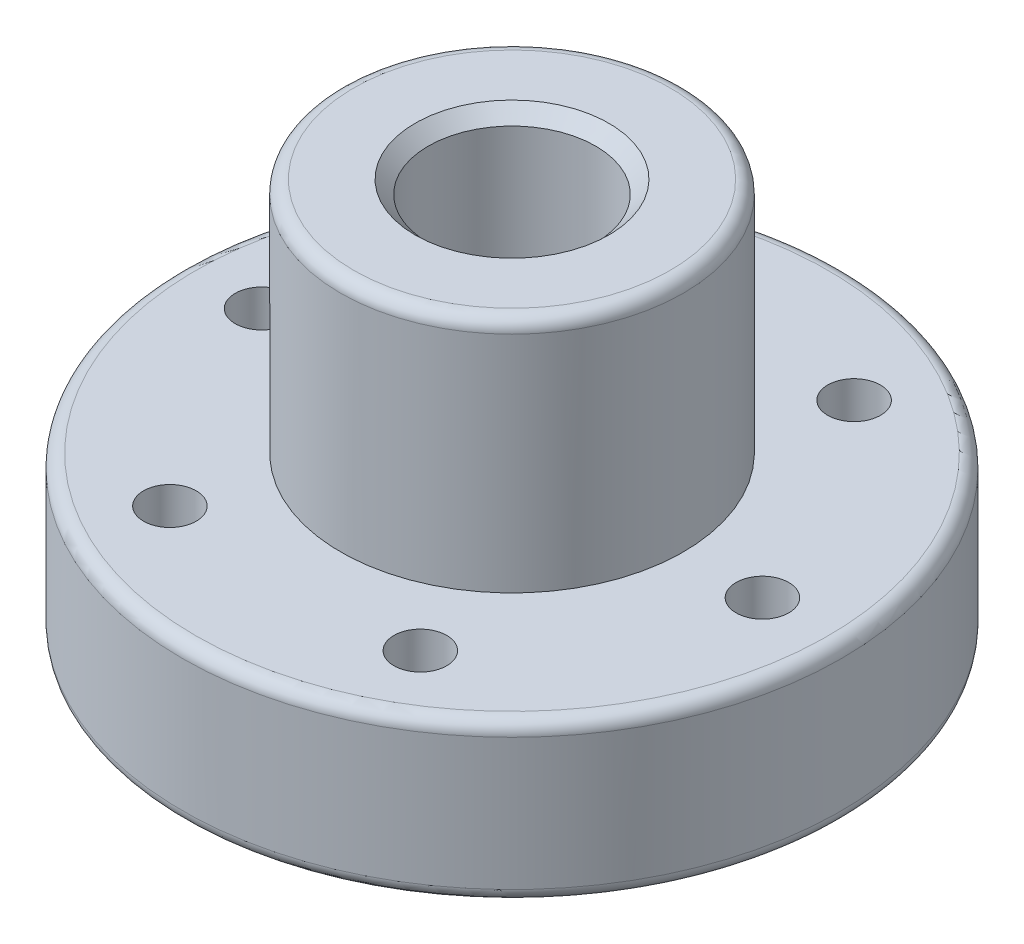
ISO-10303-21;
HEADER;
FILE_DESCRIPTION(('STEP AP214'),'2;1');
FILE_NAME('part.step','',(''),(''),'','','');
FILE_SCHEMA(('AUTOMOTIVE_DESIGN { 1 0 10303 214 1 1 1 1 }'));
ENDSEC;
DATA;
#1=APPLICATION_CONTEXT('core data for automotive mechanical design processes');
#2=APPLICATION_PROTOCOL_DEFINITION('international standard','automotive_design',2000,#1);
#3=PRODUCT_CONTEXT('',#1,'mechanical');
#4=PRODUCT('Part','Part','',(#3));
#5=PRODUCT_RELATED_PRODUCT_CATEGORY('part','',(#4));
#6=PRODUCT_DEFINITION_FORMATION('','',#4);
#7=PRODUCT_DEFINITION_CONTEXT('part definition',#1,'design');
#8=PRODUCT_DEFINITION('design','',#6,#7);
#9=PRODUCT_DEFINITION_SHAPE('','',#8);
#10=(LENGTH_UNIT() NAMED_UNIT(*) SI_UNIT(.MILLI.,.METRE.));
#11=(NAMED_UNIT(*) PLANE_ANGLE_UNIT() SI_UNIT($,.RADIAN.));
#12=(NAMED_UNIT(*) SI_UNIT($,.STERADIAN.) SOLID_ANGLE_UNIT());
#13=UNCERTAINTY_MEASURE_WITH_UNIT(LENGTH_MEASURE(1.E-05),#10,'distance_accuracy_value','');
#14=(GEOMETRIC_REPRESENTATION_CONTEXT(3) GLOBAL_UNCERTAINTY_ASSIGNED_CONTEXT((#13)) GLOBAL_UNIT_ASSIGNED_CONTEXT((#10,
#11,#12)) REPRESENTATION_CONTEXT('',''));
#15=CARTESIAN_POINT('',(0.,0.,0.));
#16=DIRECTION('',(0.,0.,1.));
#17=DIRECTION('',(1.,0.,0.));
#18=AXIS2_PLACEMENT_3D('',#15,#16,#17);
#19=CARTESIAN_POINT('',(6.5,15.,0.));
#20=DIRECTION('',(0.,1.,0.));
#21=DIRECTION('',(0.,0.,1.));
#22=AXIS2_PLACEMENT_3D('',#19,#20,#21);
#23=PLANE('',#22);
#24=CARTESIAN_POINT('',(0.,15.,0.));
#25=DIRECTION('',(0.,1.,0.));
#26=DIRECTION('',(0.,0.,1.));
#27=AXIS2_PLACEMENT_3D('',#24,#25,#26);
#28=CIRCLE('',#27,3.675);
#29=CARTESIAN_POINT('',(0.,15.,3.675));
#30=VERTEX_POINT('',#29);
#31=EDGE_CURVE('E10',#30,#30,#28,.F.);
#32=ORIENTED_EDGE('',*,*,#31,.T.);
#33=EDGE_LOOP('',(#32));
#34=FACE_BOUND('',#33,.T.);
#35=CARTESIAN_POINT('',(0.,15.,0.));
#36=DIRECTION('',(0.,1.,0.));
#37=DIRECTION('',(0.,0.,1.));
#38=AXIS2_PLACEMENT_3D('',#35,#36,#37);
#39=CIRCLE('',#38,6.);
#40=CARTESIAN_POINT('',(0.,15.,6.));
#41=VERTEX_POINT('',#40);
#42=EDGE_CURVE('E78',#41,#41,#39,.T.);
#43=ORIENTED_EDGE('',*,*,#42,.T.);
#44=EDGE_LOOP('',(#43));
#45=FACE_BOUND('',#44,.T.);
#46=ADVANCED_FACE('F45',(#34,#45),#23,.T.);
#47=CARTESIAN_POINT('',(0.,0.,0.));
#48=DIRECTION('',(0.,-1.,0.));
#49=DIRECTION('',(0.,0.,-1.));
#50=AXIS2_PLACEMENT_3D('',#47,#48,#49);
#51=CYLINDRICAL_SURFACE('',#50,3.175);
#52=CARTESIAN_POINT('',(0.,0.5,0.));
#53=DIRECTION('',(0.,-1.,0.));
#54=DIRECTION('',(0.,0.,-1.));
#55=AXIS2_PLACEMENT_3D('',#52,#53,#54);
#56=CIRCLE('',#55,3.175);
#57=CARTESIAN_POINT('',(0.,0.5,-3.175));
#58=VERTEX_POINT('',#57);
#59=EDGE_CURVE('E57',#58,#58,#56,.T.);
#60=ORIENTED_EDGE('',*,*,#59,.T.);
#61=EDGE_LOOP('',(#60));
#62=FACE_BOUND('',#61,.T.);
#63=CARTESIAN_POINT('',(0.,14.5,0.));
#64=DIRECTION('',(0.,1.,0.));
#65=DIRECTION('',(0.,0.,1.));
#66=AXIS2_PLACEMENT_3D('',#63,#64,#65);
#67=CIRCLE('',#66,3.175);
#68=CARTESIAN_POINT('',(0.,14.5,3.175));
#69=VERTEX_POINT('',#68);
#70=EDGE_CURVE('E61',#69,#69,#67,.T.);
#71=ORIENTED_EDGE('',*,*,#70,.T.);
#72=EDGE_LOOP('',(#71));
#73=FACE_BOUND('',#72,.T.);
#74=ADVANCED_FACE('F159',(#62,#73),#51,.F.);
#75=CARTESIAN_POINT('',(12.5,0.,0.));
#76=DIRECTION('',(0.,-1.,0.));
#77=DIRECTION('',(0.,0.,-1.));
#78=AXIS2_PLACEMENT_3D('',#75,#76,#77);
#79=PLANE('',#78);
#80=CARTESIAN_POINT('',(0.,0.,0.));
#81=DIRECTION('',(0.,-1.,0.));
#82=DIRECTION('',(0.,0.,-1.));
#83=AXIS2_PLACEMENT_3D('',#80,#81,#82);
#84=CIRCLE('',#83,3.675);
#85=CARTESIAN_POINT('',(0.,0.,-3.675));
#86=VERTEX_POINT('',#85);
#87=EDGE_CURVE('E53',#86,#86,#84,.F.);
#88=ORIENTED_EDGE('',*,*,#87,.T.);
#89=EDGE_LOOP('',(#88));
#90=FACE_BOUND('',#89,.T.);
#91=CARTESIAN_POINT('',(0.,0.,0.));
#92=DIRECTION('',(0.,-1.,0.));
#93=DIRECTION('',(0.,0.,-1.));
#94=AXIS2_PLACEMENT_3D('',#91,#92,#93);
#95=CIRCLE('',#94,12.);
#96=CARTESIAN_POINT('',(0.,0.,-12.));
#97=VERTEX_POINT('',#96);
#98=EDGE_CURVE('E75',#97,#97,#95,.T.);
#99=ORIENTED_EDGE('',*,*,#98,.T.);
#100=EDGE_LOOP('',(#99));
#101=FACE_BOUND('',#100,.T.);
#102=CARTESIAN_POINT('',(4.7500000000001,0.,-8.22724133595211));
#103=DIRECTION('',(0.,1.,0.));
#104=DIRECTION('',(0.866025403784433,0.,0.50000000000001));
#105=AXIS2_PLACEMENT_3D('',#102,#103,#104);
#106=CIRCLE('',#105,1.00000000000001);
#107=CARTESIAN_POINT('',(5.61602540378453,0.,-7.7272413359521));
#108=VERTEX_POINT('',#107);
#109=EDGE_CURVE('E103',#108,#108,#106,.T.);
#110=ORIENTED_EDGE('',*,*,#109,.T.);
#111=EDGE_LOOP('',(#110));
#112=FACE_BOUND('',#111,.T.);
#113=CARTESIAN_POINT('',(-4.74999999999992,0.,-8.22724133595221));
#114=DIRECTION('',(0.,1.,0.));
#115=DIRECTION('',(0.866025403784443,0.,-0.499999999999992));
#116=AXIS2_PLACEMENT_3D('',#113,#114,#115);
#117=CIRCLE('',#116,1.00000000000001);
#118=CARTESIAN_POINT('',(-3.88397459621547,0.,-8.7272413359522));
#119=VERTEX_POINT('',#118);
#120=EDGE_CURVE('E109',#119,#119,#117,.T.);
#121=ORIENTED_EDGE('',*,*,#120,.T.);
#122=EDGE_LOOP('',(#121));
#123=FACE_BOUND('',#122,.T.);
#124=CARTESIAN_POINT('',(-9.5,0.,0.));
#125=DIRECTION('',(0.,1.,0.));
#126=DIRECTION('',(0.,0.,-1.));
#127=AXIS2_PLACEMENT_3D('',#124,#125,#126);
#128=CIRCLE('',#127,1.00000000000001);
#129=CARTESIAN_POINT('',(-9.5,0.,-1.00000000000001));
#130=VERTEX_POINT('',#129);
#131=EDGE_CURVE('E115',#130,#130,#128,.T.);
#132=ORIENTED_EDGE('',*,*,#131,.T.);
#133=EDGE_LOOP('',(#132));
#134=FACE_BOUND('',#133,.T.);
#135=CARTESIAN_POINT('',(-4.75000000000004,0.,8.22724133595214));
#136=DIRECTION('',(0.,1.,0.));
#137=DIRECTION('',(-0.866025403784436,0.,-0.500000000000004));
#138=AXIS2_PLACEMENT_3D('',#135,#136,#137);
#139=CIRCLE('',#138,1.00000000000001);
#140=CARTESIAN_POINT('',(-5.61602540378448,0.,7.72724133595214));
#141=VERTEX_POINT('',#140);
#142=EDGE_CURVE('E97',#141,#141,#139,.T.);
#143=ORIENTED_EDGE('',*,*,#142,.T.);
#144=EDGE_LOOP('',(#143));
#145=FACE_BOUND('',#144,.T.);
#146=CARTESIAN_POINT('',(4.74999999999998,0.,8.22724133595218));
#147=DIRECTION('',(0.,1.,0.));
#148=DIRECTION('',(-0.86602540378444,0.,0.499999999999998));
#149=AXIS2_PLACEMENT_3D('',#146,#147,#148);
#150=CIRCLE('',#149,1.00000000000001);
#151=CARTESIAN_POINT('',(3.88397459621554,0.,8.72724133595218));
#152=VERTEX_POINT('',#151);
#153=EDGE_CURVE('E91',#152,#152,#150,.T.);
#154=ORIENTED_EDGE('',*,*,#153,.T.);
#155=EDGE_LOOP('',(#154));
#156=FACE_BOUND('',#155,.T.);
#157=CARTESIAN_POINT('',(9.5,0.,0.));
#158=DIRECTION('',(0.,1.,0.));
#159=DIRECTION('',(0.,0.,1.));
#160=AXIS2_PLACEMENT_3D('',#157,#158,#159);
#161=CIRCLE('',#160,1.00000000000001);
#162=CARTESIAN_POINT('',(9.5,0.,1.00000000000001));
#163=VERTEX_POINT('',#162);
#164=EDGE_CURVE('E87',#163,#163,#161,.T.);
#165=ORIENTED_EDGE('',*,*,#164,.T.);
#166=EDGE_LOOP('',(#165));
#167=FACE_BOUND('',#166,.T.);
#168=ADVANCED_FACE('F124',(#90,#101,#112,#123,#134,#145,#156,#167),#79,.T.);
#169=CARTESIAN_POINT('',(0.,0.,0.));
#170=DIRECTION('',(0.,-1.,0.));
#171=DIRECTION('',(0.,0.,-1.));
#172=AXIS2_PLACEMENT_3D('',#169,#170,#171);
#173=CYLINDRICAL_SURFACE('',#172,12.5);
#174=CARTESIAN_POINT('',(0.,0.5,0.));
#175=DIRECTION('',(0.,-1.,0.));
#176=DIRECTION('',(0.,0.,-1.));
#177=AXIS2_PLACEMENT_3D('',#174,#175,#176);
#178=CIRCLE('',#177,12.5);
#179=CARTESIAN_POINT('',(0.,0.5,-12.5));
#180=VERTEX_POINT('',#179);
#181=EDGE_CURVE('E69',#180,#180,#178,.F.);
#182=ORIENTED_EDGE('',*,*,#181,.T.);
#183=EDGE_LOOP('',(#182));
#184=FACE_BOUND('',#183,.T.);
#185=CARTESIAN_POINT('',(0.,5.5,0.));
#186=DIRECTION('',(0.,1.,0.));
#187=DIRECTION('',(0.,0.,1.));
#188=AXIS2_PLACEMENT_3D('',#185,#186,#187);
#189=CIRCLE('',#188,12.5);
#190=CARTESIAN_POINT('',(0.,5.5,12.5));
#191=VERTEX_POINT('',#190);
#192=EDGE_CURVE('E72',#191,#191,#189,.F.);
#193=ORIENTED_EDGE('',*,*,#192,.T.);
#194=EDGE_LOOP('',(#193));
#195=FACE_BOUND('',#194,.T.);
#196=ADVANCED_FACE('F139',(#184,#195),#173,.T.);
#197=CARTESIAN_POINT('',(6.5,6.,0.));
#198=DIRECTION('',(0.,1.,0.));
#199=DIRECTION('',(0.,0.,1.));
#200=AXIS2_PLACEMENT_3D('',#197,#198,#199);
#201=PLANE('',#200);
#202=CARTESIAN_POINT('',(0.,6.,0.));
#203=DIRECTION('',(0.,1.,0.));
#204=DIRECTION('',(0.,0.,1.));
#205=AXIS2_PLACEMENT_3D('',#202,#203,#204);
#206=CIRCLE('',#205,12.);
#207=CARTESIAN_POINT('',(0.,6.,12.));
#208=VERTEX_POINT('',#207);
#209=EDGE_CURVE('E66',#208,#208,#206,.T.);
#210=ORIENTED_EDGE('',*,*,#209,.T.);
#211=EDGE_LOOP('',(#210));
#212=FACE_BOUND('',#211,.T.);
#213=CARTESIAN_POINT('',(4.7500000000001,6.,-8.22724133595211));
#214=DIRECTION('',(0.,1.,0.));
#215=DIRECTION('',(0.866025403784433,0.,0.50000000000001));
#216=AXIS2_PLACEMENT_3D('',#213,#214,#215);
#217=CIRCLE('',#216,1.00000000000001);
#218=CARTESIAN_POINT('',(5.61602540378453,6.,-7.7272413359521));
#219=VERTEX_POINT('',#218);
#220=EDGE_CURVE('E100',#219,#219,#217,.T.);
#221=ORIENTED_EDGE('',*,*,#220,.F.);
#222=EDGE_LOOP('',(#221));
#223=FACE_BOUND('',#222,.T.);
#224=CARTESIAN_POINT('',(-4.74999999999992,6.,-8.22724133595221));
#225=DIRECTION('',(0.,1.,0.));
#226=DIRECTION('',(0.866025403784443,0.,-0.499999999999992));
#227=AXIS2_PLACEMENT_3D('',#224,#225,#226);
#228=CIRCLE('',#227,1.00000000000001);
#229=CARTESIAN_POINT('',(-3.88397459621547,6.,-8.7272413359522));
#230=VERTEX_POINT('',#229);
#231=EDGE_CURVE('E106',#230,#230,#228,.T.);
#232=ORIENTED_EDGE('',*,*,#231,.F.);
#233=EDGE_LOOP('',(#232));
#234=FACE_BOUND('',#233,.T.);
#235=CARTESIAN_POINT('',(-9.5,6.,0.));
#236=DIRECTION('',(0.,1.,0.));
#237=DIRECTION('',(0.,0.,-1.));
#238=AXIS2_PLACEMENT_3D('',#235,#236,#237);
#239=CIRCLE('',#238,1.00000000000001);
#240=CARTESIAN_POINT('',(-9.5,6.,-1.00000000000001));
#241=VERTEX_POINT('',#240);
#242=EDGE_CURVE('E112',#241,#241,#239,.T.);
#243=ORIENTED_EDGE('',*,*,#242,.F.);
#244=EDGE_LOOP('',(#243));
#245=FACE_BOUND('',#244,.T.);
#246=CARTESIAN_POINT('',(-4.75000000000004,6.,8.22724133595214));
#247=DIRECTION('',(0.,1.,0.));
#248=DIRECTION('',(-0.866025403784436,0.,-0.500000000000004));
#249=AXIS2_PLACEMENT_3D('',#246,#247,#248);
#250=CIRCLE('',#249,1.00000000000001);
#251=CARTESIAN_POINT('',(-5.61602540378448,6.,7.72724133595214));
#252=VERTEX_POINT('',#251);
#253=EDGE_CURVE('E118',#252,#252,#250,.T.);
#254=ORIENTED_EDGE('',*,*,#253,.F.);
#255=EDGE_LOOP('',(#254));
#256=FACE_BOUND('',#255,.T.);
#257=CARTESIAN_POINT('',(4.74999999999998,6.,8.22724133595218));
#258=DIRECTION('',(0.,1.,0.));
#259=DIRECTION('',(-0.86602540378444,0.,0.499999999999998));
#260=AXIS2_PLACEMENT_3D('',#257,#258,#259);
#261=CIRCLE('',#260,1.00000000000001);
#262=CARTESIAN_POINT('',(3.88397459621554,6.,8.72724133595218));
#263=VERTEX_POINT('',#262);
#264=EDGE_CURVE('E94',#263,#263,#261,.T.);
#265=ORIENTED_EDGE('',*,*,#264,.F.);
#266=EDGE_LOOP('',(#265));
#267=FACE_BOUND('',#266,.T.);
#268=CARTESIAN_POINT('',(9.5,6.,0.));
#269=DIRECTION('',(0.,1.,0.));
#270=DIRECTION('',(0.,0.,1.));
#271=AXIS2_PLACEMENT_3D('',#268,#269,#270);
#272=CIRCLE('',#271,1.00000000000001);
#273=CARTESIAN_POINT('',(9.5,6.,1.00000000000001));
#274=VERTEX_POINT('',#273);
#275=EDGE_CURVE('E88',#274,#274,#272,.T.);
#276=ORIENTED_EDGE('',*,*,#275,.F.);
#277=EDGE_LOOP('',(#276));
#278=FACE_BOUND('',#277,.T.);
#279=CARTESIAN_POINT('',(0.,6.,0.));
#280=DIRECTION('',(0.,-1.,0.));
#281=DIRECTION('',(0.,0.,-1.));
#282=AXIS2_PLACEMENT_3D('',#279,#280,#281);
#283=CIRCLE('',#282,6.5);
#284=CARTESIAN_POINT('',(0.,6.,-6.5));
#285=VERTEX_POINT('',#284);
#286=EDGE_CURVE('E84',#285,#285,#283,.T.);
#287=ORIENTED_EDGE('',*,*,#286,.T.);
#288=EDGE_LOOP('',(#287));
#289=FACE_BOUND('',#288,.T.);
#290=ADVANCED_FACE('F135',(#212,#223,#234,#245,#256,#267,#278,#289),#201,.T.);
#291=CARTESIAN_POINT('',(0.,0.,0.));
#292=DIRECTION('',(0.,-1.,0.));
#293=DIRECTION('',(0.,0.,-1.));
#294=AXIS2_PLACEMENT_3D('',#291,#292,#293);
#295=CYLINDRICAL_SURFACE('',#294,6.5);
#296=CARTESIAN_POINT('',(0.,14.5,0.));
#297=DIRECTION('',(0.,1.,0.));
#298=DIRECTION('',(0.,0.,1.));
#299=AXIS2_PLACEMENT_3D('',#296,#297,#298);
#300=CIRCLE('',#299,6.5);
#301=CARTESIAN_POINT('',(0.,14.5,6.5));
#302=VERTEX_POINT('',#301);
#303=EDGE_CURVE('E81',#302,#302,#300,.F.);
#304=ORIENTED_EDGE('',*,*,#303,.T.);
#305=EDGE_LOOP('',(#304));
#306=FACE_BOUND('',#305,.T.);
#307=ORIENTED_EDGE('',*,*,#286,.F.);
#308=EDGE_LOOP('',(#307));
#309=FACE_BOUND('',#308,.T.);
#310=ADVANCED_FACE('F138',(#306,#309),#295,.T.);
#311=CARTESIAN_POINT('',(9.5,0.,0.));
#312=DIRECTION('',(0.,1.,0.));
#313=DIRECTION('',(0.,0.,1.));
#314=AXIS2_PLACEMENT_3D('',#311,#312,#313);
#315=CYLINDRICAL_SURFACE('',#314,1.00000000000001);
#316=ORIENTED_EDGE('',*,*,#164,.F.);
#317=EDGE_LOOP('',(#316));
#318=FACE_BOUND('',#317,.T.);
#319=ORIENTED_EDGE('',*,*,#275,.T.);
#320=EDGE_LOOP('',(#319));
#321=FACE_BOUND('',#320,.T.);
#322=ADVANCED_FACE('F149',(#318,#321),#315,.F.);
#323=CARTESIAN_POINT('',(4.74999999999998,0.,8.22724133595218));
#324=DIRECTION('',(0.,1.,0.));
#325=DIRECTION('',(0.,0.,1.));
#326=AXIS2_PLACEMENT_3D('',#323,#324,#325);
#327=CYLINDRICAL_SURFACE('',#326,1.00000000000001);
#328=ORIENTED_EDGE('',*,*,#153,.F.);
#329=EDGE_LOOP('',(#328));
#330=FACE_BOUND('',#329,.T.);
#331=ORIENTED_EDGE('',*,*,#264,.T.);
#332=EDGE_LOOP('',(#331));
#333=FACE_BOUND('',#332,.T.);
#334=ADVANCED_FACE('F131',(#330,#333),#327,.F.);
#335=CARTESIAN_POINT('',(-4.75000000000004,0.,8.22724133595214));
#336=DIRECTION('',(0.,1.,0.));
#337=DIRECTION('',(0.,0.,1.));
#338=AXIS2_PLACEMENT_3D('',#335,#336,#337);
#339=CYLINDRICAL_SURFACE('',#338,1.00000000000001);
#340=ORIENTED_EDGE('',*,*,#142,.F.);
#341=EDGE_LOOP('',(#340));
#342=FACE_BOUND('',#341,.T.);
#343=ORIENTED_EDGE('',*,*,#253,.T.);
#344=EDGE_LOOP('',(#343));
#345=FACE_BOUND('',#344,.T.);
#346=ADVANCED_FACE('F127',(#342,#345),#339,.F.);
#347=CARTESIAN_POINT('',(-9.5,0.,0.));
#348=DIRECTION('',(0.,1.,0.));
#349=DIRECTION('',(0.,0.,1.));
#350=AXIS2_PLACEMENT_3D('',#347,#348,#349);
#351=CYLINDRICAL_SURFACE('',#350,1.00000000000001);
#352=ORIENTED_EDGE('',*,*,#131,.F.);
#353=EDGE_LOOP('',(#352));
#354=FACE_BOUND('',#353,.T.);
#355=ORIENTED_EDGE('',*,*,#242,.T.);
#356=EDGE_LOOP('',(#355));
#357=FACE_BOUND('',#356,.T.);
#358=ADVANCED_FACE('F130',(#354,#357),#351,.F.);
#359=CARTESIAN_POINT('',(-4.74999999999992,0.,-8.22724133595221));
#360=DIRECTION('',(0.,1.,0.));
#361=DIRECTION('',(0.,0.,1.));
#362=AXIS2_PLACEMENT_3D('',#359,#360,#361);
#363=CYLINDRICAL_SURFACE('',#362,1.00000000000001);
#364=ORIENTED_EDGE('',*,*,#120,.F.);
#365=EDGE_LOOP('',(#364));
#366=FACE_BOUND('',#365,.T.);
#367=ORIENTED_EDGE('',*,*,#231,.T.);
#368=EDGE_LOOP('',(#367));
#369=FACE_BOUND('',#368,.T.);
#370=ADVANCED_FACE('F231',(#366,#369),#363,.F.);
#371=CARTESIAN_POINT('',(4.7500000000001,0.,-8.22724133595211));
#372=DIRECTION('',(0.,1.,0.));
#373=DIRECTION('',(0.,0.,1.));
#374=AXIS2_PLACEMENT_3D('',#371,#372,#373);
#375=CYLINDRICAL_SURFACE('',#374,1.00000000000001);
#376=ORIENTED_EDGE('',*,*,#109,.F.);
#377=EDGE_LOOP('',(#376));
#378=FACE_BOUND('',#377,.T.);
#379=ORIENTED_EDGE('',*,*,#220,.T.);
#380=EDGE_LOOP('',(#379));
#381=FACE_BOUND('',#380,.T.);
#382=ADVANCED_FACE('F173',(#378,#381),#375,.F.);
#383=CARTESIAN_POINT('',(0.,14.5,0.));
#384=DIRECTION('',(0.,1.,0.));
#385=DIRECTION('',(0.,0.,1.));
#386=AXIS2_PLACEMENT_3D('',#383,#384,#385);
#387=TOROIDAL_SURFACE('',#386,6.,0.5);
#388=ORIENTED_EDGE('',*,*,#42,.F.);
#389=EDGE_LOOP('',(#388));
#390=FACE_BOUND('',#389,.T.);
#391=ORIENTED_EDGE('',*,*,#303,.F.);
#392=EDGE_LOOP('',(#391));
#393=FACE_BOUND('',#392,.T.);
#394=ADVANCED_FACE('F170',(#390,#393),#387,.T.);
#395=CARTESIAN_POINT('',(0.,0.5,0.));
#396=DIRECTION('',(0.,-1.,0.));
#397=DIRECTION('',(0.,0.,-1.));
#398=AXIS2_PLACEMENT_3D('',#395,#396,#397);
#399=TOROIDAL_SURFACE('',#398,12.,0.5);
#400=ORIENTED_EDGE('',*,*,#181,.F.);
#401=EDGE_LOOP('',(#400));
#402=FACE_BOUND('',#401,.T.);
#403=ORIENTED_EDGE('',*,*,#98,.F.);
#404=EDGE_LOOP('',(#403));
#405=FACE_BOUND('',#404,.T.);
#406=ADVANCED_FACE('F172',(#402,#405),#399,.T.);
#407=CARTESIAN_POINT('',(0.,5.5,0.));
#408=DIRECTION('',(0.,1.,0.));
#409=DIRECTION('',(0.,0.,1.));
#410=AXIS2_PLACEMENT_3D('',#407,#408,#409);
#411=TOROIDAL_SURFACE('',#410,12.,0.5);
#412=ORIENTED_EDGE('',*,*,#209,.F.);
#413=EDGE_LOOP('',(#412));
#414=FACE_BOUND('',#413,.T.);
#415=ORIENTED_EDGE('',*,*,#192,.F.);
#416=EDGE_LOOP('',(#415));
#417=FACE_BOUND('',#416,.T.);
#418=ADVANCED_FACE('F177',(#414,#417),#411,.T.);
#419=CARTESIAN_POINT('',(0.,0.5,0.));
#420=DIRECTION('',(0.,-1.,0.));
#421=DIRECTION('',(0.,0.,-1.));
#422=AXIS2_PLACEMENT_3D('',#419,#420,#421);
#423=CONICAL_SURFACE('',#422,3.175,0.785398163397451);
#424=ORIENTED_EDGE('',*,*,#87,.F.);
#425=EDGE_LOOP('',(#424));
#426=FACE_BOUND('',#425,.T.);
#427=ORIENTED_EDGE('',*,*,#59,.F.);
#428=EDGE_LOOP('',(#427));
#429=FACE_BOUND('',#428,.T.);
#430=ADVANCED_FACE('F179',(#426,#429),#423,.F.);
#431=CARTESIAN_POINT('',(0.,15.,0.));
#432=DIRECTION('',(0.,1.,0.));
#433=DIRECTION('',(0.,0.,1.));
#434=AXIS2_PLACEMENT_3D('',#431,#432,#433);
#435=CONICAL_SURFACE('',#434,3.675,0.78539816339745);
#436=ORIENTED_EDGE('',*,*,#70,.F.);
#437=EDGE_LOOP('',(#436));
#438=FACE_BOUND('',#437,.T.);
#439=ORIENTED_EDGE('',*,*,#31,.F.);
#440=EDGE_LOOP('',(#439));
#441=FACE_BOUND('',#440,.T.);
#442=ADVANCED_FACE('F48',(#438,#441),#435,.F.);
#443=CLOSED_SHELL('',(#46,#74,#168,#196,#290,#310,#322,#334,#346,#358,#370,#382,#394,#406,#418,
#430,#442));
#444=MANIFOLD_SOLID_BREP('B2',#443);
#445=ADVANCED_BREP_SHAPE_REPRESENTATION('',(#18,#444),#14);
#446=SHAPE_DEFINITION_REPRESENTATION(#9,#445);
ENDSEC;
END-ISO-10303-21;
